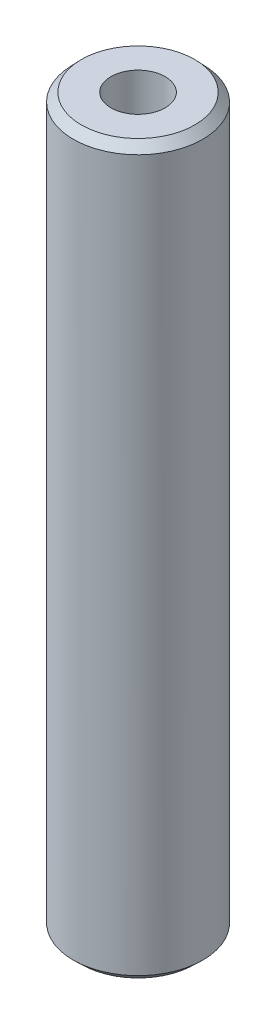
ISO-10303-21;
HEADER;
FILE_DESCRIPTION(('STEP AP214'),'2;1');
FILE_NAME('part.step','',(''),(''),'','','');
FILE_SCHEMA(('AUTOMOTIVE_DESIGN { 1 0 10303 214 1 1 1 1 }'));
ENDSEC;
DATA;
#1=APPLICATION_CONTEXT('core data for automotive mechanical design processes');
#2=APPLICATION_PROTOCOL_DEFINITION('international standard','automotive_design',2000,#1);
#3=PRODUCT_CONTEXT('',#1,'mechanical');
#4=PRODUCT('Part','Part','',(#3));
#5=PRODUCT_RELATED_PRODUCT_CATEGORY('part','',(#4));
#6=PRODUCT_DEFINITION_FORMATION('','',#4);
#7=PRODUCT_DEFINITION_CONTEXT('part definition',#1,'design');
#8=PRODUCT_DEFINITION('design','',#6,#7);
#9=PRODUCT_DEFINITION_SHAPE('','',#8);
#10=(LENGTH_UNIT() NAMED_UNIT(*) SI_UNIT(.MILLI.,.METRE.));
#11=(NAMED_UNIT(*) PLANE_ANGLE_UNIT() SI_UNIT($,.RADIAN.));
#12=(NAMED_UNIT(*) SI_UNIT($,.STERADIAN.) SOLID_ANGLE_UNIT());
#13=UNCERTAINTY_MEASURE_WITH_UNIT(LENGTH_MEASURE(1.E-05),#10,'distance_accuracy_value','');
#14=(GEOMETRIC_REPRESENTATION_CONTEXT(3) GLOBAL_UNCERTAINTY_ASSIGNED_CONTEXT((#13)) GLOBAL_UNIT_ASSIGNED_CONTEXT((#10,
#11,#12)) REPRESENTATION_CONTEXT('',''));
#15=CARTESIAN_POINT('',(0.,0.,0.));
#16=DIRECTION('',(0.,0.,1.));
#17=DIRECTION('',(1.,0.,0.));
#18=AXIS2_PLACEMENT_3D('',#15,#16,#17);
#19=CARTESIAN_POINT('',(0.,112.385703904899,0.));
#20=DIRECTION('',(0.,-1.,0.));
#21=DIRECTION('',(0.,0.,-1.));
#22=AXIS2_PLACEMENT_3D('',#19,#20,#21);
#23=CYLINDRICAL_SURFACE('',#22,10.);
#24=CARTESIAN_POINT('',(0.,111.082513694745,0.));
#25=DIRECTION('',(0.,1.,0.));
#26=DIRECTION('',(0.,0.,1.));
#27=AXIS2_PLACEMENT_3D('',#24,#25,#26);
#28=CIRCLE('',#27,10.);
#29=CARTESIAN_POINT('',(0.,111.082513694745,-10.));
#30=VERTEX_POINT('',#29);
#31=EDGE_CURVE('E50',#30,#30,#28,.F.);
#32=CARTESIAN_POINT('',(0.,1.23703552260471,0.));
#33=DIRECTION('',(0.,1.,0.));
#34=DIRECTION('',(0.,0.,1.));
#35=AXIS2_PLACEMENT_3D('',#32,#33,#34);
#36=CIRCLE('',#35,10.);
#37=CARTESIAN_POINT('',(0.,1.23703552260469,-10.));
#38=VERTEX_POINT('',#37);
#39=EDGE_CURVE('E51',#38,#38,#36,.T.);
#40=CARTESIAN_POINT('',(0.,111.082513694745,-10.));
#41=CARTESIAN_POINT('',(0.,109.938289963786,-10.));
#42=CARTESIAN_POINT('',(0.,108.794066232826,-10.));
#43=CARTESIAN_POINT('',(0.,106.505618770906,-10.));
#44=CARTESIAN_POINT('',(0.,105.361395039946,-10.));
#45=CARTESIAN_POINT('',(0.,103.072947578027,-10.));
#46=CARTESIAN_POINT('',(0.,101.928723847067,-10.));
#47=CARTESIAN_POINT('',(0.,99.6402763851474,-10.));
#48=CARTESIAN_POINT('',(0.,98.4960526541876,-10.));
#49=CARTESIAN_POINT('',(0.,96.207605192268,-10.));
#50=CARTESIAN_POINT('',(0.,95.0633814613082,-10.));
#51=CARTESIAN_POINT('',(0.,92.7749339993886,-10.));
#52=CARTESIAN_POINT('',(0.,91.6307102684288,-10.));
#53=CARTESIAN_POINT('',(0.,89.3422628065092,-10.));
#54=CARTESIAN_POINT('',(0.,88.1980390755494,-10.));
#55=CARTESIAN_POINT('',(0.,85.9095916136298,-10.));
#56=CARTESIAN_POINT('',(0.,84.76536788267,-10.));
#57=CARTESIAN_POINT('',(0.,82.4769204207504,-10.));
#58=CARTESIAN_POINT('',(0.,81.3326966897906,-10.));
#59=CARTESIAN_POINT('',(0.,79.044249227871,-10.));
#60=CARTESIAN_POINT('',(0.,77.9000254969112,-10.));
#61=CARTESIAN_POINT('',(0.,75.6115780349916,-10.));
#62=CARTESIAN_POINT('',(0.,74.4673543040318,-10.));
#63=CARTESIAN_POINT('',(0.,72.1789068421122,-10.));
#64=CARTESIAN_POINT('',(0.,71.0346831111524,-10.));
#65=CARTESIAN_POINT('',(0.,68.7462356492328,-10.));
#66=CARTESIAN_POINT('',(0.,67.602011918273,-10.));
#67=CARTESIAN_POINT('',(0.,65.3135644563534,-10.));
#68=CARTESIAN_POINT('',(0.,64.1693407253936,-10.));
#69=CARTESIAN_POINT('',(0.,61.880893263474,-10.));
#70=CARTESIAN_POINT('',(0.,60.7366695325142,-10.));
#71=CARTESIAN_POINT('',(0.,58.4482220705946,-10.));
#72=CARTESIAN_POINT('',(0.,57.3039983396348,-10.));
#73=CARTESIAN_POINT('',(0.,55.0155508777152,-10.));
#74=CARTESIAN_POINT('',(0.,53.8713271467554,-10.));
#75=CARTESIAN_POINT('',(0.,51.5828796848358,-10.));
#76=CARTESIAN_POINT('',(0.,50.438655953876,-10.));
#77=CARTESIAN_POINT('',(0.,48.1502084919565,-10.));
#78=CARTESIAN_POINT('',(0.,47.0059847609966,-10.));
#79=CARTESIAN_POINT('',(0.,44.7175372990771,-10.));
#80=CARTESIAN_POINT('',(0.,43.5733135681172,-10.));
#81=CARTESIAN_POINT('',(0.,41.2848661061977,-10.));
#82=CARTESIAN_POINT('',(0.,40.1406423752379,-10.));
#83=CARTESIAN_POINT('',(0.,37.8521949133183,-10.));
#84=CARTESIAN_POINT('',(0.,36.7079711823585,-10.));
#85=CARTESIAN_POINT('',(0.,34.4195237204389,-10.));
#86=CARTESIAN_POINT('',(0.,33.2752999894791,-10.));
#87=CARTESIAN_POINT('',(0.,30.9868525275595,-10.));
#88=CARTESIAN_POINT('',(0.,29.8426287965997,-10.));
#89=CARTESIAN_POINT('',(0.,27.5541813346801,-10.));
#90=CARTESIAN_POINT('',(0.,26.4099576037203,-10.));
#91=CARTESIAN_POINT('',(0.,24.1215101418007,-10.));
#92=CARTESIAN_POINT('',(0.,22.9772864108409,-10.));
#93=CARTESIAN_POINT('',(0.,20.6888389489213,-10.));
#94=CARTESIAN_POINT('',(0.,19.5446152179615,-10.));
#95=CARTESIAN_POINT('',(0.,17.2561677560419,-10.));
#96=CARTESIAN_POINT('',(0.,16.1119440250821,-10.));
#97=CARTESIAN_POINT('',(0.,13.8234965631625,-10.));
#98=CARTESIAN_POINT('',(0.,12.6792728322027,-10.));
#99=CARTESIAN_POINT('',(0.,10.3908253702831,-10.));
#100=CARTESIAN_POINT('',(0.,9.2466016393233,-10.));
#101=CARTESIAN_POINT('',(0.,6.9581541774037,-10.));
#102=CARTESIAN_POINT('',(0.,5.8139304464439,-10.));
#103=CARTESIAN_POINT('',(0.,3.5254829845243,-10.));
#104=CARTESIAN_POINT('',(0.,2.38125925356449,-10.));
#105=CARTESIAN_POINT('',(0.,1.23703552260469,-10.));
#106=B_SPLINE_CURVE_WITH_KNOTS('',3,(#40,#41,#42,#43,#44,#45,#46,#47,#48,#49,#50,#51,#52,#53,
#54,#55,#56,#57,#58,#59,#60,#61,#62,#63,#64,#65,#66,#67,#68,#69,#70,#71,#72,#73,#74,#75,#76,#77,
#78,#79,#80,#81,#82,#83,#84,#85,#86,#87,#88,#89,#90,#91,#92,#93,#94,#95,#96,#97,#98,#99,#100,
#101,#102,#103,#104,#105),.UNSPECIFIED.,.F.,.F.,(4,2,2,2,2,2,2,2,2,2,2,2,2,2,2,2,2,2,2,2,2,2,2,
2,2,2,2,2,2,2,2,2,4),(0.,3.4326711928794,6.8653423857588,10.2980135786382,13.7306847715176,
17.163355964397,20.5960271572764,24.0286983501558,27.4613695430352,30.8940407359146,
34.326711928794,37.7593831216734,41.1920543145528,44.6247255074322,48.0573967003115,
51.4900678931909,54.9227390860703,58.3554102789497,61.7880814718291,65.2207526647085,
68.6534238575879,72.0860950504673,75.5187662433467,78.9514374362261,82.3841086291055,
85.8167798219849,89.2494510148643,92.6821222077437,96.1147934006231,99.5474645935025,
102.980135786382,106.412806979261,109.845478172141),.UNSPECIFIED.);
#107=EDGE_CURVE('BSEAM39',#30,#38,#106,.T.);
#108=ORIENTED_EDGE('',*,*,#31,.T.);
#109=ORIENTED_EDGE('',*,*,#39,.T.);
#110=ORIENTED_EDGE('',*,*,#107,.T.);
#111=ORIENTED_EDGE('',*,*,#107,.F.);
#112=EDGE_LOOP('',(#108,#110,#109,#111));
#113=FACE_BOUND('',#112,.T.);
#114=ADVANCED_FACE('F39',(#113),#23,.T.);
#115=CARTESIAN_POINT('',(0.,112.385703904899,0.));
#116=DIRECTION('',(0.,1.,0.));
#117=DIRECTION('',(0.,0.,1.));
#118=AXIS2_PLACEMENT_3D('',#115,#116,#117);
#119=PLANE('',#118);
#120=CARTESIAN_POINT('',(0.,112.385703904899,0.));
#121=DIRECTION('',(0.,1.,0.));
#122=DIRECTION('',(0.,0.,1.));
#123=AXIS2_PLACEMENT_3D('',#120,#121,#122);
#124=CIRCLE('',#123,8.76296447739547);
#125=CARTESIAN_POINT('',(0.,112.385703904899,8.76296447739547));
#126=VERTEX_POINT('',#125);
#127=EDGE_CURVE('E54',#126,#126,#124,.T.);
#128=ORIENTED_EDGE('',*,*,#127,.T.);
#129=EDGE_LOOP('',(#128));
#130=FACE_BOUND('',#129,.T.);
#131=CARTESIAN_POINT('',(0.,112.385703904899,0.));
#132=DIRECTION('',(0.,1.,0.));
#133=DIRECTION('',(0.,0.,1.));
#134=AXIS2_PLACEMENT_3D('',#131,#132,#133);
#135=CIRCLE('',#134,4.1895061377964);
#136=CARTESIAN_POINT('',(0.,112.385703904899,-4.1895061377964));
#137=VERTEX_POINT('',#136);
#138=EDGE_CURVE('E58',#137,#137,#135,.T.);
#139=ORIENTED_EDGE('',*,*,#138,.F.);
#140=EDGE_LOOP('',(#139));
#141=FACE_BOUND('',#140,.T.);
#142=ADVANCED_FACE('F69',(#130,#141),#119,.T.);
#143=CARTESIAN_POINT('',(0.,0.,0.));
#144=DIRECTION('',(0.,1.,0.));
#145=DIRECTION('',(0.,0.,1.));
#146=AXIS2_PLACEMENT_3D('',#143,#144,#145);
#147=PLANE('',#146);
#148=CARTESIAN_POINT('',(0.,0.,0.));
#149=DIRECTION('',(0.,1.,0.));
#150=DIRECTION('',(0.,0.,1.));
#151=AXIS2_PLACEMENT_3D('',#148,#149,#150);
#152=CIRCLE('',#151,8.69680978984596);
#153=CARTESIAN_POINT('',(0.,0.,8.69680978984596));
#154=VERTEX_POINT('',#153);
#155=EDGE_CURVE('E10',#154,#154,#152,.F.);
#156=ORIENTED_EDGE('',*,*,#155,.T.);
#157=EDGE_LOOP('',(#156));
#158=FACE_BOUND('',#157,.T.);
#159=CARTESIAN_POINT('',(0.,0.,0.));
#160=DIRECTION('',(0.,1.,0.));
#161=DIRECTION('',(0.,0.,1.));
#162=AXIS2_PLACEMENT_3D('',#159,#160,#161);
#163=CIRCLE('',#162,4.1895061377964);
#164=CARTESIAN_POINT('',(0.,0.,-4.1895061377964));
#165=VERTEX_POINT('',#164);
#166=EDGE_CURVE('E63',#165,#165,#163,.T.);
#167=ORIENTED_EDGE('',*,*,#166,.T.);
#168=EDGE_LOOP('',(#167));
#169=FACE_BOUND('',#168,.T.);
#170=ADVANCED_FACE('F75',(#158,#169),#147,.F.);
#171=CARTESIAN_POINT('',(0.,112.385703904899,0.));
#172=DIRECTION('',(0.,-1.,0.));
#173=DIRECTION('',(0.,0.,-1.));
#174=AXIS2_PLACEMENT_3D('',#171,#172,#173);
#175=CYLINDRICAL_SURFACE('',#174,4.1895061377964);
#176=CARTESIAN_POINT('',(0.,112.385703904899,-4.1895061377964));
#177=CARTESIAN_POINT('',(0.,111.215019489223,-4.1895061377964));
#178=CARTESIAN_POINT('',(0.,110.044335073547,-4.1895061377964));
#179=CARTESIAN_POINT('',(0.,107.702966242195,-4.1895061377964));
#180=CARTESIAN_POINT('',(0.,106.532281826519,-4.1895061377964));
#181=CARTESIAN_POINT('',(0.,104.190912995167,-4.1895061377964));
#182=CARTESIAN_POINT('',(0.,103.020228579491,-4.1895061377964));
#183=CARTESIAN_POINT('',(0.,100.678859748139,-4.1895061377964));
#184=CARTESIAN_POINT('',(0.,99.5081753324629,-4.1895061377964));
#185=CARTESIAN_POINT('',(0.,97.1668065011108,-4.1895061377964));
#186=CARTESIAN_POINT('',(0.,95.9961220854348,-4.1895061377964));
#187=CARTESIAN_POINT('',(0.,93.6547532540827,-4.1895061377964));
#188=CARTESIAN_POINT('',(0.,92.4840688384067,-4.1895061377964));
#189=CARTESIAN_POINT('',(0.,90.1427000070546,-4.1895061377964));
#190=CARTESIAN_POINT('',(0.,88.9720155913786,-4.1895061377964));
#191=CARTESIAN_POINT('',(0.,86.6306467600265,-4.1895061377964));
#192=CARTESIAN_POINT('',(0.,85.4599623443505,-4.1895061377964));
#193=CARTESIAN_POINT('',(0.,83.1185935129984,-4.1895061377964));
#194=CARTESIAN_POINT('',(0.,81.9479090973224,-4.1895061377964));
#195=CARTESIAN_POINT('',(0.,79.6065402659703,-4.1895061377964));
#196=CARTESIAN_POINT('',(0.,78.4358558502943,-4.1895061377964));
#197=CARTESIAN_POINT('',(0.,76.0944870189422,-4.1895061377964));
#198=CARTESIAN_POINT('',(0.,74.9238026032662,-4.1895061377964));
#199=CARTESIAN_POINT('',(0.,72.5824337719141,-4.1895061377964));
#200=CARTESIAN_POINT('',(0.,71.411749356238,-4.1895061377964));
#201=CARTESIAN_POINT('',(0.,69.070380524886,-4.1895061377964));
#202=CARTESIAN_POINT('',(0.,67.89969610921,-4.1895061377964));
#203=CARTESIAN_POINT('',(0.,65.5583272778579,-4.1895061377964));
#204=CARTESIAN_POINT('',(0.,64.3876428621819,-4.1895061377964));
#205=CARTESIAN_POINT('',(0.,62.0462740308298,-4.1895061377964));
#206=CARTESIAN_POINT('',(0.,60.8755896151537,-4.1895061377964));
#207=CARTESIAN_POINT('',(0.,58.5342207838017,-4.1895061377964));
#208=CARTESIAN_POINT('',(0.,57.3635363681257,-4.1895061377964));
#209=CARTESIAN_POINT('',(0.,55.0221675367736,-4.1895061377964));
#210=CARTESIAN_POINT('',(0.,53.8514831210975,-4.1895061377964));
#211=CARTESIAN_POINT('',(0.,51.5101142897455,-4.1895061377964));
#212=CARTESIAN_POINT('',(0.,50.3394298740694,-4.1895061377964));
#213=CARTESIAN_POINT('',(0.,47.9980610427174,-4.1895061377964));
#214=CARTESIAN_POINT('',(0.,46.8273766270413,-4.1895061377964));
#215=CARTESIAN_POINT('',(0.,44.4860077956893,-4.1895061377964));
#216=CARTESIAN_POINT('',(0.,43.3153233800132,-4.1895061377964));
#217=CARTESIAN_POINT('',(0.,40.9739545486612,-4.1895061377964));
#218=CARTESIAN_POINT('',(0.,39.8032701329851,-4.1895061377964));
#219=CARTESIAN_POINT('',(0.,37.4619013016331,-4.1895061377964));
#220=CARTESIAN_POINT('',(0.,36.291216885957,-4.1895061377964));
#221=CARTESIAN_POINT('',(0.,33.949848054605,-4.1895061377964));
#222=CARTESIAN_POINT('',(0.,32.7791636389289,-4.1895061377964));
#223=CARTESIAN_POINT('',(0.,30.4377948075769,-4.1895061377964));
#224=CARTESIAN_POINT('',(0.,29.2671103919008,-4.1895061377964));
#225=CARTESIAN_POINT('',(0.,26.9257415605488,-4.1895061377964));
#226=CARTESIAN_POINT('',(0.,25.7550571448727,-4.1895061377964));
#227=CARTESIAN_POINT('',(0.,23.4136883135207,-4.1895061377964));
#228=CARTESIAN_POINT('',(0.,22.2430038978446,-4.1895061377964));
#229=CARTESIAN_POINT('',(0.,19.9016350664926,-4.1895061377964));
#230=CARTESIAN_POINT('',(0.,18.7309506508165,-4.1895061377964));
#231=CARTESIAN_POINT('',(0.,16.3895818194645,-4.1895061377964));
#232=CARTESIAN_POINT('',(0.,15.2188974037884,-4.1895061377964));
#233=CARTESIAN_POINT('',(0.,12.8775285724364,-4.1895061377964));
#234=CARTESIAN_POINT('',(0.,11.7068441567603,-4.1895061377964));
#235=CARTESIAN_POINT('',(0.,9.36547532540826,-4.1895061377964));
#236=CARTESIAN_POINT('',(0.,8.19479090973222,-4.1895061377964));
#237=CARTESIAN_POINT('',(0.,5.85342207838015,-4.1895061377964));
#238=CARTESIAN_POINT('',(0.,4.68273766270412,-4.1895061377964));
#239=CARTESIAN_POINT('',(0.,2.34136883135206,-4.1895061377964));
#240=CARTESIAN_POINT('',(0.,1.17068441567602,-4.1895061377964));
#241=CARTESIAN_POINT('',(0.,0.,-4.1895061377964));
#242=B_SPLINE_CURVE_WITH_KNOTS('',3,(#176,#177,#178,#179,#180,#181,#182,#183,#184,#185,#186,
#187,#188,#189,#190,#191,#192,#193,#194,#195,#196,#197,#198,#199,#200,#201,#202,#203,#204,#205,
#206,#207,#208,#209,#210,#211,#212,#213,#214,#215,#216,#217,#218,#219,#220,#221,#222,#223,#224,
#225,#226,#227,#228,#229,#230,#231,#232,#233,#234,#235,#236,#237,#238,#239,#240,#241),
.UNSPECIFIED.,.F.,.F.,(4,2,2,2,2,2,2,2,2,2,2,2,2,2,2,2,2,2,2,2,2,2,2,2,2,2,2,2,2,2,2,2,4),(0.,
3.51205324702809,7.0241064940562,10.5361597410843,14.0482129881124,17.5602662351405,
21.0723194821686,24.5843727291967,28.0964259762248,31.6084792232529,35.120532470281,
38.6325857173091,42.1446389643372,45.6566922113653,49.1687454583934,52.6807987054215,
56.1928519524496,59.7049051994777,63.2169584465058,66.7290116935339,70.241064940562,
73.7531181875901,77.2651714346182,80.7772246816463,84.2892779286744,87.8013311757025,
91.3133844227306,94.8254376697587,98.3374909167868,101.849544163815,105.361597410843,
108.873650657871,112.385703904899),.UNSPECIFIED.);
#243=EDGE_CURVE('BSEAM70',#137,#165,#242,.T.);
#244=ORIENTED_EDGE('',*,*,#138,.T.);
#245=ORIENTED_EDGE('',*,*,#166,.F.);
#246=ORIENTED_EDGE('',*,*,#243,.T.);
#247=ORIENTED_EDGE('',*,*,#243,.F.);
#248=EDGE_LOOP('',(#244,#246,#245,#247));
#249=FACE_BOUND('',#248,.T.);
#250=ADVANCED_FACE('F70',(#249),#175,.F.);
#251=CARTESIAN_POINT('',(0.,112.385703904899,0.));
#252=DIRECTION('',(0.,-1.,0.));
#253=DIRECTION('',(0.,0.,-1.));
#254=AXIS2_PLACEMENT_3D('',#251,#252,#253);
#255=CONICAL_SURFACE('',#254,8.76296447739547,0.759361210554549);
#256=ORIENTED_EDGE('',*,*,#31,.F.);
#257=EDGE_LOOP('',(#256));
#258=FACE_BOUND('',#257,.T.);
#259=ORIENTED_EDGE('',*,*,#127,.F.);
#260=EDGE_LOOP('',(#259));
#261=FACE_BOUND('',#260,.T.);
#262=ADVANCED_FACE('F81',(#258,#261),#255,.T.);
#263=CARTESIAN_POINT('',(0.,1.23703552260471,0.));
#264=DIRECTION('',(0.,1.,0.));
#265=DIRECTION('',(0.,0.,1.));
#266=AXIS2_PLACEMENT_3D('',#263,#264,#265);
#267=CONICAL_SURFACE('',#266,10.,0.811435116240344);
#268=ORIENTED_EDGE('',*,*,#155,.F.);
#269=EDGE_LOOP('',(#268));
#270=FACE_BOUND('',#269,.T.);
#271=ORIENTED_EDGE('',*,*,#39,.F.);
#272=EDGE_LOOP('',(#271));
#273=FACE_BOUND('',#272,.T.);
#274=ADVANCED_FACE('F45',(#270,#273),#267,.T.);
#275=CLOSED_SHELL('',(#114,#142,#170,#250,#262,#274));
#276=MANIFOLD_SOLID_BREP('B2',#275);
#277=ADVANCED_BREP_SHAPE_REPRESENTATION('',(#18,#276),#14);
#278=SHAPE_DEFINITION_REPRESENTATION(#9,#277);
ENDSEC;
END-ISO-10303-21;
